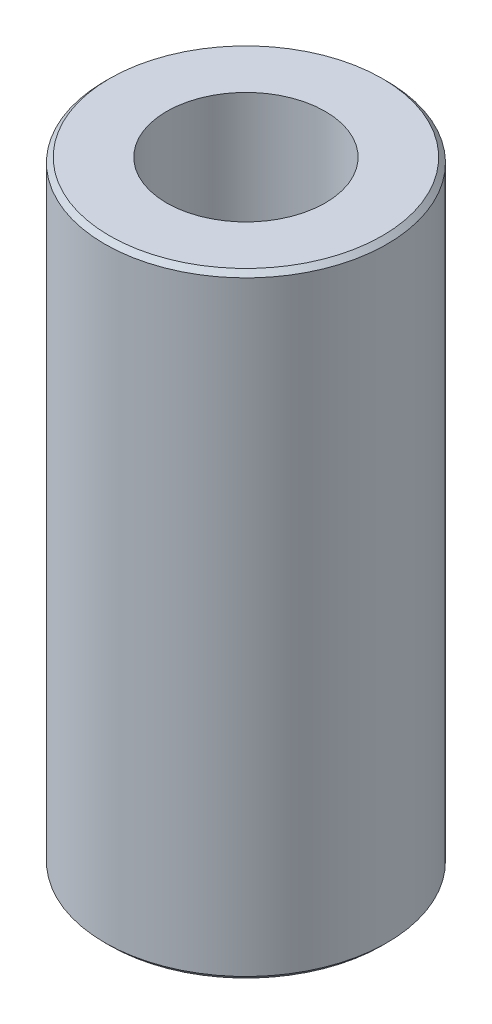
ISO-10303-21;
HEADER;
FILE_DESCRIPTION(('STEP AP214'),'2;1');
FILE_NAME('part.step','',(''),(''),'','','');
FILE_SCHEMA(('AUTOMOTIVE_DESIGN { 1 0 10303 214 1 1 1 1 }'));
ENDSEC;
DATA;
#1=APPLICATION_CONTEXT('core data for automotive mechanical design processes');
#2=APPLICATION_PROTOCOL_DEFINITION('international standard','automotive_design',2000,#1);
#3=PRODUCT_CONTEXT('',#1,'mechanical');
#4=PRODUCT('Part','Part','',(#3));
#5=PRODUCT_RELATED_PRODUCT_CATEGORY('part','',(#4));
#6=PRODUCT_DEFINITION_FORMATION('','',#4);
#7=PRODUCT_DEFINITION_CONTEXT('part definition',#1,'design');
#8=PRODUCT_DEFINITION('design','',#6,#7);
#9=PRODUCT_DEFINITION_SHAPE('','',#8);
#10=(LENGTH_UNIT() NAMED_UNIT(*) SI_UNIT(.MILLI.,.METRE.));
#11=(NAMED_UNIT(*) PLANE_ANGLE_UNIT() SI_UNIT($,.RADIAN.));
#12=(NAMED_UNIT(*) SI_UNIT($,.STERADIAN.) SOLID_ANGLE_UNIT());
#13=UNCERTAINTY_MEASURE_WITH_UNIT(LENGTH_MEASURE(1.E-05),#10,'distance_accuracy_value','');
#14=(GEOMETRIC_REPRESENTATION_CONTEXT(3) GLOBAL_UNCERTAINTY_ASSIGNED_CONTEXT((#13)) GLOBAL_UNIT_ASSIGNED_CONTEXT((#10,
#11,#12)) REPRESENTATION_CONTEXT('',''));
#15=CARTESIAN_POINT('',(0.,0.,0.));
#16=DIRECTION('',(0.,0.,1.));
#17=DIRECTION('',(1.,0.,0.));
#18=AXIS2_PLACEMENT_3D('',#15,#16,#17);
#19=CARTESIAN_POINT('',(0.,261.346993344532,0.));
#20=DIRECTION('',(0.,-1.,0.));
#21=DIRECTION('',(0.,0.,-1.));
#22=AXIS2_PLACEMENT_3D('',#19,#20,#21);
#23=CYLINDRICAL_SURFACE('',#22,60.);
#24=CARTESIAN_POINT('',(0.,259.3112102251,0.));
#25=DIRECTION('',(0.,1.,0.));
#26=DIRECTION('',(0.,0.,1.));
#27=AXIS2_PLACEMENT_3D('',#24,#25,#26);
#28=CIRCLE('',#27,60.);
#29=CARTESIAN_POINT('',(0.,259.3112102251,60.));
#30=VERTEX_POINT('',#29);
#31=EDGE_CURVE('E50',#30,#30,#28,.F.);
#32=ORIENTED_EDGE('',*,*,#31,.T.);
#33=EDGE_LOOP('',(#32));
#34=FACE_BOUND('',#33,.T.);
#35=CARTESIAN_POINT('',(0.,2.0357831194317,0.));
#36=DIRECTION('',(0.,1.,0.));
#37=DIRECTION('',(0.,0.,1.));
#38=AXIS2_PLACEMENT_3D('',#35,#36,#37);
#39=CIRCLE('',#38,60.);
#40=CARTESIAN_POINT('',(0.,2.0357831194317,60.));
#41=VERTEX_POINT('',#40);
#42=EDGE_CURVE('E51',#41,#41,#39,.T.);
#43=ORIENTED_EDGE('',*,*,#42,.T.);
#44=EDGE_LOOP('',(#43));
#45=FACE_BOUND('',#44,.T.);
#46=ADVANCED_FACE('F39',(#34,#45),#23,.T.);
#47=CARTESIAN_POINT('',(0.,261.346993344532,0.));
#48=DIRECTION('',(0.,1.,0.));
#49=DIRECTION('',(0.,0.,1.));
#50=AXIS2_PLACEMENT_3D('',#47,#48,#49);
#51=PLANE('',#50);
#52=CARTESIAN_POINT('',(0.,261.346993344532,0.));
#53=DIRECTION('',(0.,1.,0.));
#54=DIRECTION('',(0.,0.,1.));
#55=AXIS2_PLACEMENT_3D('',#52,#53,#54);
#56=CIRCLE('',#55,57.9642168805682);
#57=CARTESIAN_POINT('',(0.,261.346993344532,57.9642168805682));
#58=VERTEX_POINT('',#57);
#59=EDGE_CURVE('E54',#58,#58,#56,.T.);
#60=ORIENTED_EDGE('',*,*,#59,.T.);
#61=EDGE_LOOP('',(#60));
#62=FACE_BOUND('',#61,.T.);
#63=CARTESIAN_POINT('',(0.,261.346993344532,0.));
#64=DIRECTION('',(0.,1.,0.));
#65=DIRECTION('',(0.,0.,1.));
#66=AXIS2_PLACEMENT_3D('',#63,#64,#65);
#67=CIRCLE('',#66,33.7455565636011);
#68=CARTESIAN_POINT('',(0.,261.346993344532,33.7455565636011));
#69=VERTEX_POINT('',#68);
#70=EDGE_CURVE('E58',#69,#69,#67,.T.);
#71=ORIENTED_EDGE('',*,*,#70,.F.);
#72=EDGE_LOOP('',(#71));
#73=FACE_BOUND('',#72,.T.);
#74=ADVANCED_FACE('F69',(#62,#73),#51,.T.);
#75=CARTESIAN_POINT('',(0.,0.,0.));
#76=DIRECTION('',(0.,1.,0.));
#77=DIRECTION('',(0.,0.,1.));
#78=AXIS2_PLACEMENT_3D('',#75,#76,#77);
#79=PLANE('',#78);
#80=CARTESIAN_POINT('',(0.,0.,0.));
#81=DIRECTION('',(0.,1.,0.));
#82=DIRECTION('',(0.,0.,1.));
#83=AXIS2_PLACEMENT_3D('',#80,#81,#82);
#84=CIRCLE('',#83,57.9642168805683);
#85=CARTESIAN_POINT('',(0.,0.,57.9642168805683));
#86=VERTEX_POINT('',#85);
#87=EDGE_CURVE('E10',#86,#86,#84,.F.);
#88=ORIENTED_EDGE('',*,*,#87,.T.);
#89=EDGE_LOOP('',(#88));
#90=FACE_BOUND('',#89,.T.);
#91=CARTESIAN_POINT('',(0.,0.,0.));
#92=DIRECTION('',(0.,1.,0.));
#93=DIRECTION('',(0.,0.,1.));
#94=AXIS2_PLACEMENT_3D('',#91,#92,#93);
#95=CIRCLE('',#94,33.7455565636011);
#96=CARTESIAN_POINT('',(0.,0.,33.7455565636011));
#97=VERTEX_POINT('',#96);
#98=EDGE_CURVE('E63',#97,#97,#95,.T.);
#99=ORIENTED_EDGE('',*,*,#98,.T.);
#100=EDGE_LOOP('',(#99));
#101=FACE_BOUND('',#100,.T.);
#102=ADVANCED_FACE('F75',(#90,#101),#79,.F.);
#103=CARTESIAN_POINT('',(0.,261.346993344532,0.));
#104=DIRECTION('',(0.,-1.,0.));
#105=DIRECTION('',(0.,0.,-1.));
#106=AXIS2_PLACEMENT_3D('',#103,#104,#105);
#107=CYLINDRICAL_SURFACE('',#106,33.7455565636011);
#108=ORIENTED_EDGE('',*,*,#70,.T.);
#109=EDGE_LOOP('',(#108));
#110=FACE_BOUND('',#109,.T.);
#111=ORIENTED_EDGE('',*,*,#98,.F.);
#112=EDGE_LOOP('',(#111));
#113=FACE_BOUND('',#112,.T.);
#114=ADVANCED_FACE('F70',(#110,#113),#107,.F.);
#115=CARTESIAN_POINT('',(0.,261.346993344532,0.));
#116=DIRECTION('',(0.,-1.,0.));
#117=DIRECTION('',(0.,0.,-1.));
#118=AXIS2_PLACEMENT_3D('',#115,#116,#117);
#119=CONICAL_SURFACE('',#118,57.9642168805682,0.785398163397455);
#120=ORIENTED_EDGE('',*,*,#31,.F.);
#121=EDGE_LOOP('',(#120));
#122=FACE_BOUND('',#121,.T.);
#123=ORIENTED_EDGE('',*,*,#59,.F.);
#124=EDGE_LOOP('',(#123));
#125=FACE_BOUND('',#124,.T.);
#126=ADVANCED_FACE('F81',(#122,#125),#119,.T.);
#127=CARTESIAN_POINT('',(0.,2.0357831194317,0.));
#128=DIRECTION('',(0.,1.,0.));
#129=DIRECTION('',(0.,0.,1.));
#130=AXIS2_PLACEMENT_3D('',#127,#128,#129);
#131=CONICAL_SURFACE('',#130,60.,0.785398163397455);
#132=ORIENTED_EDGE('',*,*,#87,.F.);
#133=EDGE_LOOP('',(#132));
#134=FACE_BOUND('',#133,.T.);
#135=ORIENTED_EDGE('',*,*,#42,.F.);
#136=EDGE_LOOP('',(#135));
#137=FACE_BOUND('',#136,.T.);
#138=ADVANCED_FACE('F45',(#134,#137),#131,.T.);
#139=CLOSED_SHELL('',(#46,#74,#102,#114,#126,#138));
#140=MANIFOLD_SOLID_BREP('B2',#139);
#141=ADVANCED_BREP_SHAPE_REPRESENTATION('',(#18,#140),#14);
#142=SHAPE_DEFINITION_REPRESENTATION(#9,#141);
ENDSEC;
END-ISO-10303-21;
